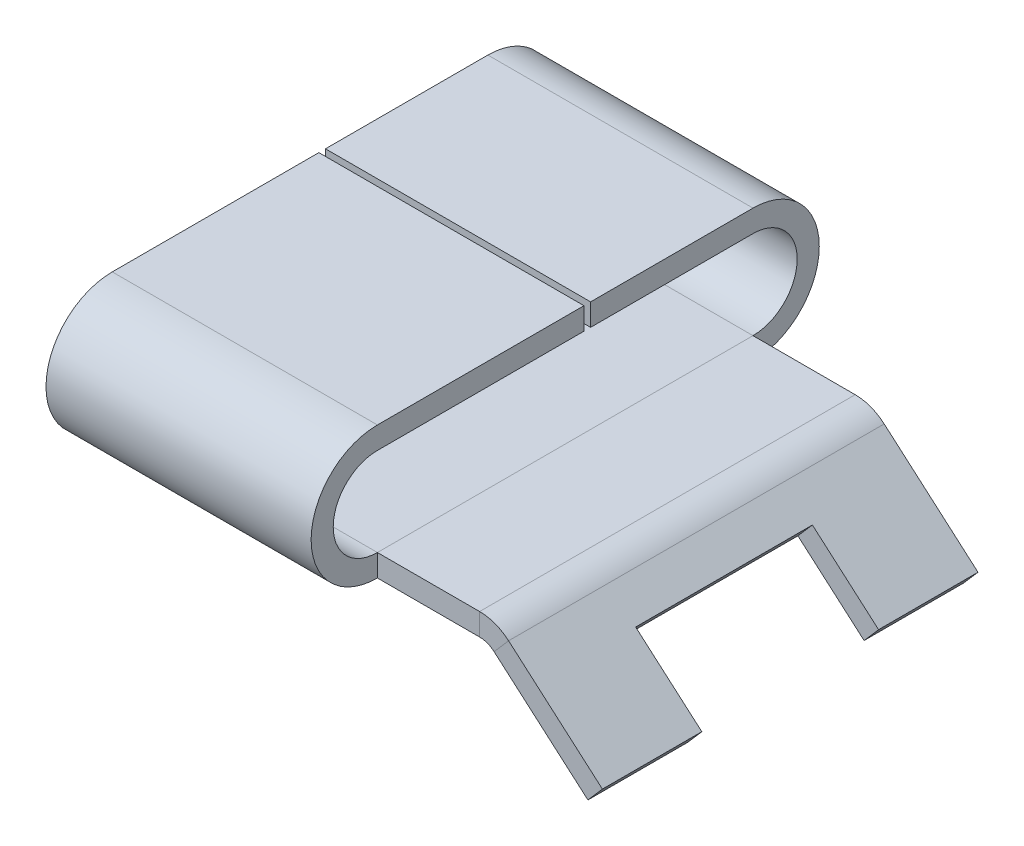
ISO-10303-21;
HEADER;
FILE_DESCRIPTION(('STEP AP214'),'2;1');
FILE_NAME('part.step','',(''),(''),'','','');
FILE_SCHEMA(('AUTOMOTIVE_DESIGN { 1 0 10303 214 1 1 1 1 }'));
ENDSEC;
DATA;
#1=APPLICATION_CONTEXT('core data for automotive mechanical design processes');
#2=APPLICATION_PROTOCOL_DEFINITION('international standard','automotive_design',2000,#1);
#3=PRODUCT_CONTEXT('',#1,'mechanical');
#4=PRODUCT('Part','Part','',(#3));
#5=PRODUCT_RELATED_PRODUCT_CATEGORY('part','',(#4));
#6=PRODUCT_DEFINITION_FORMATION('','',#4);
#7=PRODUCT_DEFINITION_CONTEXT('part definition',#1,'design');
#8=PRODUCT_DEFINITION('design','',#6,#7);
#9=PRODUCT_DEFINITION_SHAPE('','',#8);
#10=(LENGTH_UNIT() NAMED_UNIT(*) SI_UNIT(.MILLI.,.METRE.));
#11=(NAMED_UNIT(*) PLANE_ANGLE_UNIT() SI_UNIT($,.RADIAN.));
#12=(NAMED_UNIT(*) SI_UNIT($,.STERADIAN.) SOLID_ANGLE_UNIT());
#13=UNCERTAINTY_MEASURE_WITH_UNIT(LENGTH_MEASURE(1.E-05),#10,'distance_accuracy_value','');
#14=(GEOMETRIC_REPRESENTATION_CONTEXT(3) GLOBAL_UNCERTAINTY_ASSIGNED_CONTEXT((#13)) GLOBAL_UNIT_ASSIGNED_CONTEXT((#10,
#11,#12)) REPRESENTATION_CONTEXT('',''));
#15=CARTESIAN_POINT('',(0.,0.,0.));
#16=DIRECTION('',(0.,0.,1.));
#17=DIRECTION('',(1.,0.,0.));
#18=AXIS2_PLACEMENT_3D('',#15,#16,#17);
#19=CARTESIAN_POINT('',(22.1843165103271,-6.1816445937203,8.5));
#20=DIRECTION('',(0.754709580222771,-0.656059028990509,0.));
#21=DIRECTION('',(0.656059028990509,0.754709580222771,0.));
#22=AXIS2_PLACEMENT_3D('',#19,#20,#21);
#23=PLANE('',#22);
#24=DIRECTION('',(-0.656059028990509,-0.754709580222771,0.));
#25=VECTOR('',#24,1.);
#26=CARTESIAN_POINT('',(12.2612803691565,-17.5967918742352,-4.));
#27=LINE('',#26,#25);
#28=CARTESIAN_POINT('',(22.1843165103271,-6.18164459372029,-4.));
#29=VERTEX_POINT('',#28);
#30=CARTESIAN_POINT('',(21.5282574813366,-6.93635417394306,-4.));
#31=VERTEX_POINT('',#30);
#32=EDGE_CURVE('E250',#29,#31,#27,.T.);
#33=ORIENTED_EDGE('',*,*,#32,.T.);
#34=DIRECTION('',(0.,0.,-1.));
#35=VECTOR('',#34,1.);
#36=CARTESIAN_POINT('',(21.5282574813366,-6.93635417394306,8.5));
#37=LINE('',#36,#35);
#38=CARTESIAN_POINT('',(21.5282574813366,-6.93635417394306,-8.5));
#39=VERTEX_POINT('',#38);
#40=EDGE_CURVE('E195',#31,#39,#37,.T.);
#41=ORIENTED_EDGE('',*,*,#40,.T.);
#42=DIRECTION('',(-0.656059028990509,-0.754709580222771,0.));
#43=VECTOR('',#42,1.);
#44=CARTESIAN_POINT('',(22.1843165103271,-6.1816445937203,-8.5));
#45=LINE('',#44,#43);
#46=CARTESIAN_POINT('',(22.1843165103271,-6.1816445937203,-8.5));
#47=VERTEX_POINT('',#46);
#48=EDGE_CURVE('E164',#47,#39,#45,.T.);
#49=ORIENTED_EDGE('',*,*,#48,.F.);
#50=DIRECTION('',(0.,0.,-1.));
#51=VECTOR('',#50,1.);
#52=CARTESIAN_POINT('',(22.1843165103271,-6.1816445937203,8.5));
#53=LINE('',#52,#51);
#54=EDGE_CURVE('E191',#29,#47,#53,.T.);
#55=ORIENTED_EDGE('',*,*,#54,.F.);
#56=EDGE_LOOP('',(#33,#41,#49,#55));
#57=FACE_BOUND('',#56,.T.);
#58=ADVANCED_FACE('F48',(#57),#23,.T.);
#59=CARTESIAN_POINT('',(16.6261153205152,-3.00000000000001,8.5));
#60=DIRECTION('',(0.,0.,1.));
#61=DIRECTION('',(1.,0.,0.));
#62=AXIS2_PLACEMENT_3D('',#59,#60,#61);
#63=PLANE('',#62);
#64=DIRECTION('',(0.,1.,0.));
#65=VECTOR('',#64,1.);
#66=CARTESIAN_POINT('',(16.6261153205152,-3.00000000000001,8.5));
#67=LINE('',#66,#65);
#68=CARTESIAN_POINT('',(16.6261153205152,-3.00000000000001,8.5));
#69=VERTEX_POINT('',#68);
#70=CARTESIAN_POINT('',(16.6261153205152,-2.00000000000001,8.5));
#71=VERTEX_POINT('',#70);
#72=EDGE_CURVE('E12',#69,#71,#67,.T.);
#73=ORIENTED_EDGE('',*,*,#72,.F.);
#74=CARTESIAN_POINT('',(16.6261153205152,-4.00000000000001,8.5));
#75=DIRECTION('',(0.,0.,-1.));
#76=DIRECTION('',(1.,0.,0.));
#77=AXIS2_PLACEMENT_3D('',#74,#75,#76);
#78=CIRCLE('',#77,0.999999999999999);
#79=CARTESIAN_POINT('',(17.2821743495057,-3.24529041977724,8.5));
#80=VERTEX_POINT('',#79);
#81=EDGE_CURVE('E148',#69,#80,#78,.T.);
#82=ORIENTED_EDGE('',*,*,#81,.T.);
#83=DIRECTION('',(-0.656059028990509,-0.754709580222771,0.));
#84=VECTOR('',#83,1.);
#85=CARTESIAN_POINT('',(17.9382333784962,-2.49058083955447,8.5));
#86=LINE('',#85,#84);
#87=CARTESIAN_POINT('',(17.9382333784962,-2.49058083955447,8.5));
#88=VERTEX_POINT('',#87);
#89=EDGE_CURVE('E56',#88,#80,#86,.T.);
#90=ORIENTED_EDGE('',*,*,#89,.F.);
#91=CARTESIAN_POINT('',(16.6261153205152,-4.00000000000001,8.5));
#92=DIRECTION('',(0.,0.,1.));
#93=DIRECTION('',(1.,0.,0.));
#94=AXIS2_PLACEMENT_3D('',#91,#92,#93);
#95=CIRCLE('',#94,2.);
#96=EDGE_CURVE('E155',#71,#88,#95,.F.);
#97=ORIENTED_EDGE('',*,*,#96,.F.);
#98=EDGE_LOOP('',(#73,#82,#90,#97));
#99=FACE_BOUND('',#98,.T.);
#100=ADVANCED_FACE('F50',(#99),#63,.T.);
#101=CARTESIAN_POINT('',(17.9382333784962,-2.49058083955447,8.5));
#102=DIRECTION('',(0.,0.,1.));
#103=DIRECTION('',(1.,0.,0.));
#104=AXIS2_PLACEMENT_3D('',#101,#102,#103);
#105=PLANE('',#104);
#106=DIRECTION('',(1.,0.,0.));
#107=VECTOR('',#106,1.);
#108=CARTESIAN_POINT('',(12.,-3.00000000000001,8.5));
#109=LINE('',#108,#107);
#110=CARTESIAN_POINT('',(12.,-3.00000000000001,8.5));
#111=VERTEX_POINT('',#110);
#112=EDGE_CURVE('E143',#111,#69,#109,.T.);
#113=ORIENTED_EDGE('',*,*,#112,.T.);
#114=ORIENTED_EDGE('',*,*,#72,.T.);
#115=DIRECTION('',(1.,0.,0.));
#116=VECTOR('',#115,1.);
#117=CARTESIAN_POINT('',(12.,-2.00000000000001,8.5));
#118=LINE('',#117,#116);
#119=CARTESIAN_POINT('',(12.,-2.00000000000001,8.5));
#120=VERTEX_POINT('',#119);
#121=EDGE_CURVE('E153',#120,#71,#118,.T.);
#122=ORIENTED_EDGE('',*,*,#121,.F.);
#123=DIRECTION('',(0.,1.,0.));
#124=VECTOR('',#123,1.);
#125=CARTESIAN_POINT('',(12.,-3.00000000000001,8.5));
#126=LINE('',#125,#124);
#127=EDGE_CURVE('E132',#111,#120,#126,.T.);
#128=ORIENTED_EDGE('',*,*,#127,.F.);
#129=EDGE_LOOP('',(#113,#114,#122,#128));
#130=FACE_BOUND('',#129,.T.);
#131=ADVANCED_FACE('F151',(#130),#105,.T.);
#132=CARTESIAN_POINT('',(17.2821743495057,-3.24529041977724,-8.5));
#133=DIRECTION('',(0.,0.,-1.));
#134=DIRECTION('',(-1.,0.,0.));
#135=AXIS2_PLACEMENT_3D('',#132,#133,#134);
#136=PLANE('',#135);
#137=DIRECTION('',(0.656059028990509,0.754709580222771,0.));
#138=VECTOR('',#137,1.);
#139=CARTESIAN_POINT('',(17.2821743495057,-3.24529041977724,-8.5));
#140=LINE('',#139,#138);
#141=CARTESIAN_POINT('',(17.2821743495057,-3.24529041977724,-8.5));
#142=VERTEX_POINT('',#141);
#143=CARTESIAN_POINT('',(17.9382333784962,-2.49058083955447,-8.5));
#144=VERTEX_POINT('',#143);
#145=EDGE_CURVE('E105',#142,#144,#140,.T.);
#146=ORIENTED_EDGE('',*,*,#145,.F.);
#147=CARTESIAN_POINT('',(16.6261153205152,-4.00000000000001,-8.5));
#148=DIRECTION('',(0.,0.,-1.));
#149=DIRECTION('',(1.,0.,0.));
#150=AXIS2_PLACEMENT_3D('',#147,#148,#149);
#151=CIRCLE('',#150,0.999999999999999);
#152=CARTESIAN_POINT('',(16.6261153205152,-3.00000000000001,-8.5));
#153=VERTEX_POINT('',#152);
#154=EDGE_CURVE('E179',#153,#142,#151,.T.);
#155=ORIENTED_EDGE('',*,*,#154,.F.);
#156=DIRECTION('',(0.,-1.,0.));
#157=VECTOR('',#156,1.);
#158=CARTESIAN_POINT('',(16.6261153205152,-2.00000000000001,-8.5));
#159=LINE('',#158,#157);
#160=CARTESIAN_POINT('',(16.6261153205152,-2.00000000000001,-8.5));
#161=VERTEX_POINT('',#160);
#162=EDGE_CURVE('E199',#161,#153,#159,.T.);
#163=ORIENTED_EDGE('',*,*,#162,.F.);
#164=CARTESIAN_POINT('',(16.6261153205152,-4.00000000000001,-8.5));
#165=DIRECTION('',(0.,0.,1.));
#166=DIRECTION('',(1.,0.,0.));
#167=AXIS2_PLACEMENT_3D('',#164,#165,#166);
#168=CIRCLE('',#167,2.);
#169=EDGE_CURVE('E171',#161,#144,#168,.F.);
#170=ORIENTED_EDGE('',*,*,#169,.T.);
#171=EDGE_LOOP('',(#146,#155,#163,#170));
#172=FACE_BOUND('',#171,.T.);
#173=ADVANCED_FACE('F217',(#172),#136,.T.);
#174=CARTESIAN_POINT('',(16.6261153205152,-2.00000000000001,-8.5));
#175=DIRECTION('',(0.,0.,-1.));
#176=DIRECTION('',(-1.,0.,0.));
#177=AXIS2_PLACEMENT_3D('',#174,#175,#176);
#178=PLANE('',#177);
#179=DIRECTION('',(0.754709580222771,-0.656059028990509,0.));
#180=VECTOR('',#179,1.);
#181=CARTESIAN_POINT('',(17.2821743495057,-3.24529041977724,-8.5));
#182=LINE('',#181,#180);
#183=EDGE_CURVE('E161',#142,#39,#182,.T.);
#184=ORIENTED_EDGE('',*,*,#183,.F.);
#185=ORIENTED_EDGE('',*,*,#145,.T.);
#186=DIRECTION('',(0.754709580222771,-0.656059028990509,0.));
#187=VECTOR('',#186,1.);
#188=CARTESIAN_POINT('',(17.9382333784962,-2.49058083955447,-8.5));
#189=LINE('',#188,#187);
#190=EDGE_CURVE('E168',#144,#47,#189,.T.);
#191=ORIENTED_EDGE('',*,*,#190,.T.);
#192=ORIENTED_EDGE('',*,*,#48,.T.);
#193=EDGE_LOOP('',(#184,#185,#191,#192));
#194=FACE_BOUND('',#193,.T.);
#195=ADVANCED_FACE('F203',(#194),#178,.T.);
#196=CARTESIAN_POINT('',(17.2821743495057,-3.24529041977724,8.5));
#197=DIRECTION('',(0.656059028990509,0.754709580222771,0.));
#198=DIRECTION('',(-0.754709580222771,0.656059028990509,0.));
#199=AXIS2_PLACEMENT_3D('',#196,#197,#198);
#200=PLANE('',#199);
#201=ORIENTED_EDGE('',*,*,#40,.F.);
#202=DIRECTION('',(0.754709580222771,-0.656059028990509,0.));
#203=VECTOR('',#202,1.);
#204=CARTESIAN_POINT('',(18.532541406042,-4.33221791942655,-4.));
#205=LINE('',#204,#203);
#206=CARTESIAN_POINT('',(18.532541406042,-4.33221791942655,-4.));
#207=VERTEX_POINT('',#206);
#208=EDGE_CURVE('E244',#207,#31,#205,.T.);
#209=ORIENTED_EDGE('',*,*,#208,.F.);
#210=DIRECTION('',(0.,0.,-1.));
#211=VECTOR('',#210,1.);
#212=CARTESIAN_POINT('',(18.532541406042,-4.33221791942655,4.));
#213=LINE('',#212,#211);
#214=CARTESIAN_POINT('',(18.532541406042,-4.33221791942655,4.));
#215=VERTEX_POINT('',#214);
#216=EDGE_CURVE('E165',#215,#207,#213,.T.);
#217=ORIENTED_EDGE('',*,*,#216,.F.);
#218=DIRECTION('',(-0.754709580222771,0.656059028990509,0.));
#219=VECTOR('',#218,1.);
#220=CARTESIAN_POINT('',(18.532541406042,-4.33221791942655,4.));
#221=LINE('',#220,#219);
#222=CARTESIAN_POINT('',(21.5282574813366,-6.93635417394306,4.));
#223=VERTEX_POINT('',#222);
#224=EDGE_CURVE('E247',#223,#215,#221,.T.);
#225=ORIENTED_EDGE('',*,*,#224,.F.);
#226=CARTESIAN_POINT('',(21.5282574813366,-6.93635417394306,8.5));
#227=VERTEX_POINT('',#226);
#228=EDGE_CURVE('E196',#227,#223,#37,.T.);
#229=ORIENTED_EDGE('',*,*,#228,.F.);
#230=DIRECTION('',(0.754709580222771,-0.656059028990509,0.));
#231=VECTOR('',#230,1.);
#232=CARTESIAN_POINT('',(17.2821743495057,-3.24529041977724,8.5));
#233=LINE('',#232,#231);
#234=EDGE_CURVE('E111',#80,#227,#233,.T.);
#235=ORIENTED_EDGE('',*,*,#234,.F.);
#236=DIRECTION('',(0.,0.,-1.));
#237=VECTOR('',#236,1.);
#238=CARTESIAN_POINT('',(17.2821743495057,-3.24529041977724,8.5));
#239=LINE('',#238,#237);
#240=EDGE_CURVE('E160',#80,#142,#239,.T.);
#241=ORIENTED_EDGE('',*,*,#240,.T.);
#242=ORIENTED_EDGE('',*,*,#183,.T.);
#243=EDGE_LOOP('',(#201,#209,#217,#225,#229,#235,#241,#242));
#244=FACE_BOUND('',#243,.T.);
#245=ADVANCED_FACE('F289',(#244),#200,.F.);
#246=DIRECTION('',(0.656059028990509,0.754709580222771,0.));
#247=VECTOR('',#246,1.);
#248=CARTESIAN_POINT('',(12.2612803691565,-17.5967918742352,4.));
#249=LINE('',#248,#247);
#250=CARTESIAN_POINT('',(22.1843165103271,-6.1816445937203,4.));
#251=VERTEX_POINT('',#250);
#252=EDGE_CURVE('E253',#223,#251,#249,.T.);
#253=ORIENTED_EDGE('',*,*,#252,.T.);
#254=CARTESIAN_POINT('',(22.1843165103271,-6.1816445937203,8.5));
#255=VERTEX_POINT('',#254);
#256=EDGE_CURVE('E192',#255,#251,#53,.T.);
#257=ORIENTED_EDGE('',*,*,#256,.F.);
#258=DIRECTION('',(-0.656059028990509,-0.754709580222771,0.));
#259=VECTOR('',#258,1.);
#260=CARTESIAN_POINT('',(22.1843165103271,-6.1816445937203,8.5));
#261=LINE('',#260,#259);
#262=EDGE_CURVE('E224',#255,#227,#261,.T.);
#263=ORIENTED_EDGE('',*,*,#262,.T.);
#264=ORIENTED_EDGE('',*,*,#228,.T.);
#265=EDGE_LOOP('',(#253,#257,#263,#264));
#266=FACE_BOUND('',#265,.T.);
#267=ADVANCED_FACE('F258',(#266),#23,.T.);
#268=CARTESIAN_POINT('',(17.9382333784962,-2.49058083955447,8.5));
#269=DIRECTION('',(0.656059028990509,0.754709580222771,0.));
#270=DIRECTION('',(-0.754709580222771,0.656059028990509,0.));
#271=AXIS2_PLACEMENT_3D('',#268,#269,#270);
#272=PLANE('',#271);
#273=DIRECTION('',(-0.754709580222771,0.656059028990509,0.));
#274=VECTOR('',#273,1.);
#275=CARTESIAN_POINT('',(19.1886004350325,-3.57750833920378,-4.));
#276=LINE('',#275,#274);
#277=CARTESIAN_POINT('',(19.1886004350325,-3.57750833920378,-4.));
#278=VERTEX_POINT('',#277);
#279=EDGE_CURVE('E63',#29,#278,#276,.T.);
#280=ORIENTED_EDGE('',*,*,#279,.F.);
#281=ORIENTED_EDGE('',*,*,#54,.T.);
#282=ORIENTED_EDGE('',*,*,#190,.F.);
#283=DIRECTION('',(0.,0.,-1.));
#284=VECTOR('',#283,1.);
#285=CARTESIAN_POINT('',(17.9382333784962,-2.49058083955447,8.5));
#286=LINE('',#285,#284);
#287=EDGE_CURVE('E188',#88,#144,#286,.T.);
#288=ORIENTED_EDGE('',*,*,#287,.F.);
#289=DIRECTION('',(0.754709580222771,-0.656059028990509,0.));
#290=VECTOR('',#289,1.);
#291=CARTESIAN_POINT('',(17.9382333784962,-2.49058083955447,8.5));
#292=LINE('',#291,#290);
#293=EDGE_CURVE('E223',#88,#255,#292,.T.);
#294=ORIENTED_EDGE('',*,*,#293,.T.);
#295=ORIENTED_EDGE('',*,*,#256,.T.);
#296=DIRECTION('',(0.754709580222771,-0.656059028990509,0.));
#297=VECTOR('',#296,1.);
#298=CARTESIAN_POINT('',(19.1886004350325,-3.57750833920378,4.));
#299=LINE('',#298,#297);
#300=CARTESIAN_POINT('',(19.1886004350325,-3.57750833920378,4.));
#301=VERTEX_POINT('',#300);
#302=EDGE_CURVE('E235',#301,#251,#299,.T.);
#303=ORIENTED_EDGE('',*,*,#302,.F.);
#304=DIRECTION('',(0.,0.,1.));
#305=VECTOR('',#304,1.);
#306=CARTESIAN_POINT('',(19.1886004350325,-3.57750833920378,4.));
#307=LINE('',#306,#305);
#308=EDGE_CURVE('E240',#278,#301,#307,.T.);
#309=ORIENTED_EDGE('',*,*,#308,.F.);
#310=EDGE_LOOP('',(#280,#281,#282,#288,#294,#295,#303,#309));
#311=FACE_BOUND('',#310,.T.);
#312=ADVANCED_FACE('F214',(#311),#272,.T.);
#313=CARTESIAN_POINT('',(16.6261153205152,-4.00000000000001,8.5));
#314=DIRECTION('',(0.,0.,-1.));
#315=DIRECTION('',(-1.,0.,0.));
#316=AXIS2_PLACEMENT_3D('',#313,#314,#315);
#317=CYLINDRICAL_SURFACE('',#316,2.);
#318=ORIENTED_EDGE('',*,*,#169,.F.);
#319=DIRECTION('',(0.,0.,-1.));
#320=VECTOR('',#319,1.);
#321=CARTESIAN_POINT('',(16.6261153205152,-2.00000000000001,8.5));
#322=LINE('',#321,#320);
#323=EDGE_CURVE('E185',#71,#161,#322,.T.);
#324=ORIENTED_EDGE('',*,*,#323,.F.);
#325=ORIENTED_EDGE('',*,*,#96,.T.);
#326=ORIENTED_EDGE('',*,*,#287,.T.);
#327=EDGE_LOOP('',(#318,#324,#325,#326));
#328=FACE_BOUND('',#327,.T.);
#329=ADVANCED_FACE('F209',(#328),#317,.T.);
#330=CARTESIAN_POINT('',(12.,-2.00000000000001,8.5));
#331=DIRECTION('',(0.,1.,0.));
#332=DIRECTION('',(0.,0.,1.));
#333=AXIS2_PLACEMENT_3D('',#330,#331,#332);
#334=PLANE('',#333);
#335=DIRECTION('',(1.,0.,0.));
#336=VECTOR('',#335,1.);
#337=CARTESIAN_POINT('',(12.,-2.00000000000001,-8.5));
#338=LINE('',#337,#336);
#339=CARTESIAN_POINT('',(12.,-2.00000000000001,-8.5));
#340=VERTEX_POINT('',#339);
#341=EDGE_CURVE('E173',#340,#161,#338,.T.);
#342=ORIENTED_EDGE('',*,*,#341,.F.);
#343=DIRECTION('',(0.,0.,-1.));
#344=VECTOR('',#343,1.);
#345=CARTESIAN_POINT('',(12.,-2.00000000000001,8.5));
#346=LINE('',#345,#344);
#347=EDGE_CURVE('E138',#120,#340,#346,.T.);
#348=ORIENTED_EDGE('',*,*,#347,.F.);
#349=ORIENTED_EDGE('',*,*,#121,.T.);
#350=ORIENTED_EDGE('',*,*,#323,.T.);
#351=EDGE_LOOP('',(#342,#348,#349,#350));
#352=FACE_BOUND('',#351,.T.);
#353=ADVANCED_FACE('F221',(#352),#334,.T.);
#354=CARTESIAN_POINT('',(12.,-3.00000000000001,8.5));
#355=DIRECTION('',(-1.,0.,0.));
#356=DIRECTION('',(0.,0.,1.));
#357=AXIS2_PLACEMENT_3D('',#354,#355,#356);
#358=PLANE('',#357);
#359=DIRECTION('',(0.,1.,0.));
#360=VECTOR('',#359,1.);
#361=CARTESIAN_POINT('',(12.,-3.00000000000001,-8.5));
#362=LINE('',#361,#360);
#363=CARTESIAN_POINT('',(12.,-3.00000000000001,-8.5));
#364=VERTEX_POINT('',#363);
#365=EDGE_CURVE('E134',#364,#340,#362,.T.);
#366=ORIENTED_EDGE('',*,*,#365,.F.);
#367=DIRECTION('',(0.,0.,-1.));
#368=VECTOR('',#367,1.);
#369=CARTESIAN_POINT('',(12.,-3.00000000000001,8.5));
#370=LINE('',#369,#368);
#371=EDGE_CURVE('E128',#111,#364,#370,.T.);
#372=ORIENTED_EDGE('',*,*,#371,.F.);
#373=ORIENTED_EDGE('',*,*,#127,.T.);
#374=ORIENTED_EDGE('',*,*,#347,.T.);
#375=EDGE_LOOP('',(#366,#372,#373,#374));
#376=FACE_BOUND('',#375,.T.);
#377=ADVANCED_FACE('F130',(#376),#358,.T.);
#378=CARTESIAN_POINT('',(12.,-3.00000000000001,8.5));
#379=DIRECTION('',(0.,1.,0.));
#380=DIRECTION('',(0.,0.,1.));
#381=AXIS2_PLACEMENT_3D('',#378,#379,#380);
#382=PLANE('',#381);
#383=DIRECTION('',(1.,0.,0.));
#384=VECTOR('',#383,1.);
#385=CARTESIAN_POINT('',(12.,-3.00000000000001,-8.5));
#386=LINE('',#385,#384);
#387=EDGE_CURVE('E177',#364,#153,#386,.T.);
#388=ORIENTED_EDGE('',*,*,#387,.T.);
#389=DIRECTION('',(0.,0.,-1.));
#390=VECTOR('',#389,1.);
#391=CARTESIAN_POINT('',(16.6261153205152,-3.00000000000001,8.5));
#392=LINE('',#391,#390);
#393=EDGE_CURVE('E139',#69,#153,#392,.T.);
#394=ORIENTED_EDGE('',*,*,#393,.F.);
#395=ORIENTED_EDGE('',*,*,#112,.F.);
#396=ORIENTED_EDGE('',*,*,#371,.T.);
#397=EDGE_LOOP('',(#388,#394,#395,#396));
#398=FACE_BOUND('',#397,.T.);
#399=ADVANCED_FACE('F144',(#398),#382,.F.);
#400=CARTESIAN_POINT('',(16.6261153205152,-4.00000000000001,8.5));
#401=DIRECTION('',(0.,0.,-1.));
#402=DIRECTION('',(-1.,0.,0.));
#403=AXIS2_PLACEMENT_3D('',#400,#401,#402);
#404=CYLINDRICAL_SURFACE('',#403,0.999999999999999);
#405=ORIENTED_EDGE('',*,*,#154,.T.);
#406=ORIENTED_EDGE('',*,*,#240,.F.);
#407=ORIENTED_EDGE('',*,*,#81,.F.);
#408=ORIENTED_EDGE('',*,*,#393,.T.);
#409=EDGE_LOOP('',(#405,#406,#407,#408));
#410=FACE_BOUND('',#409,.T.);
#411=ADVANCED_FACE('F269',(#410),#404,.F.);
#412=CARTESIAN_POINT('',(16.6261153205152,-4.00000000000001,8.5));
#413=DIRECTION('',(0.,0.,1.));
#414=DIRECTION('',(1.,0.,0.));
#415=AXIS2_PLACEMENT_3D('',#412,#413,#414);
#416=PLANE('',#415);
#417=ORIENTED_EDGE('',*,*,#234,.T.);
#418=ORIENTED_EDGE('',*,*,#262,.F.);
#419=ORIENTED_EDGE('',*,*,#293,.F.);
#420=ORIENTED_EDGE('',*,*,#89,.T.);
#421=EDGE_LOOP('',(#417,#418,#419,#420));
#422=FACE_BOUND('',#421,.T.);
#423=ADVANCED_FACE('F266',(#422),#416,.T.);
#424=CARTESIAN_POINT('',(16.6261153205152,-4.00000000000001,-8.5));
#425=DIRECTION('',(0.,0.,1.));
#426=DIRECTION('',(1.,0.,0.));
#427=AXIS2_PLACEMENT_3D('',#424,#425,#426);
#428=PLANE('',#427);
#429=ORIENTED_EDGE('',*,*,#341,.T.);
#430=ORIENTED_EDGE('',*,*,#162,.T.);
#431=ORIENTED_EDGE('',*,*,#387,.F.);
#432=ORIENTED_EDGE('',*,*,#365,.T.);
#433=EDGE_LOOP('',(#429,#430,#431,#432));
#434=FACE_BOUND('',#433,.T.);
#435=ADVANCED_FACE('F268',(#434),#428,.F.);
#436=CARTESIAN_POINT('',(9.26556429386191,-14.9926556197187,-4.));
#437=DIRECTION('',(0.,0.,-1.));
#438=DIRECTION('',(-1.,0.,0.));
#439=AXIS2_PLACEMENT_3D('',#436,#437,#438);
#440=PLANE('',#439);
#441=ORIENTED_EDGE('',*,*,#208,.T.);
#442=ORIENTED_EDGE('',*,*,#32,.F.);
#443=ORIENTED_EDGE('',*,*,#279,.T.);
#444=DIRECTION('',(0.656059028990509,0.754709580222771,0.));
#445=VECTOR('',#444,1.);
#446=CARTESIAN_POINT('',(9.26556429386191,-14.9926556197187,-4.));
#447=LINE('',#446,#445);
#448=EDGE_CURVE('E233',#207,#278,#447,.T.);
#449=ORIENTED_EDGE('',*,*,#448,.F.);
#450=EDGE_LOOP('',(#441,#442,#443,#449));
#451=FACE_BOUND('',#450,.T.);
#452=ADVANCED_FACE('F275',(#451),#440,.F.);
#453=CARTESIAN_POINT('',(9.26556429386192,-14.9926556197187,4.));
#454=DIRECTION('',(0.,0.,1.));
#455=DIRECTION('',(1.,0.,0.));
#456=AXIS2_PLACEMENT_3D('',#453,#454,#455);
#457=PLANE('',#456);
#458=ORIENTED_EDGE('',*,*,#224,.T.);
#459=DIRECTION('',(0.656059028990509,0.754709580222771,0.));
#460=VECTOR('',#459,1.);
#461=CARTESIAN_POINT('',(9.26556429386192,-14.9926556197187,4.));
#462=LINE('',#461,#460);
#463=EDGE_CURVE('E232',#215,#301,#462,.T.);
#464=ORIENTED_EDGE('',*,*,#463,.T.);
#465=ORIENTED_EDGE('',*,*,#302,.T.);
#466=ORIENTED_EDGE('',*,*,#252,.F.);
#467=EDGE_LOOP('',(#458,#464,#465,#466));
#468=FACE_BOUND('',#467,.T.);
#469=ADVANCED_FACE('F402',(#468),#457,.F.);
#470=CARTESIAN_POINT('',(9.26556429386192,-14.9926556197187,4.));
#471=DIRECTION('',(-0.754709580222771,0.656059028990509,0.));
#472=DIRECTION('',(-0.656059028990509,-0.754709580222771,0.));
#473=AXIS2_PLACEMENT_3D('',#470,#471,#472);
#474=PLANE('',#473);
#475=ORIENTED_EDGE('',*,*,#216,.T.);
#476=ORIENTED_EDGE('',*,*,#448,.T.);
#477=ORIENTED_EDGE('',*,*,#308,.T.);
#478=ORIENTED_EDGE('',*,*,#463,.F.);
#479=EDGE_LOOP('',(#475,#476,#477,#478));
#480=FACE_BOUND('',#479,.T.);
#481=ADVANCED_FACE('F410',(#480),#474,.F.);
#482=CLOSED_SHELL('',(#58,#100,#131,#173,#195,#245,#267,#312,#329,#353,#377,#399,#411,#423,#435,
#452,#469,#481));
#483=MANIFOLD_SOLID_BREP('B2',#482);
#484=CARTESIAN_POINT('',(12.,2.,-0.849999999999997));
#485=DIRECTION('',(0.,0.,1.));
#486=DIRECTION('',(1.,0.,0.));
#487=AXIS2_PLACEMENT_3D('',#484,#485,#486);
#488=PLANE('',#487);
#489=DIRECTION('',(0.,1.,0.));
#490=VECTOR('',#489,1.);
#491=CARTESIAN_POINT('',(0.,2.,-0.849999999999997));
#492=LINE('',#491,#490);
#493=CARTESIAN_POINT('',(0.,2.,-0.849999999999997));
#494=VERTEX_POINT('',#493);
#495=CARTESIAN_POINT('',(0.,3.,-0.849999999999997));
#496=VERTEX_POINT('',#495);
#497=EDGE_CURVE('E583',#494,#496,#492,.T.);
#498=ORIENTED_EDGE('',*,*,#497,.T.);
#499=DIRECTION('',(-1.,0.,0.));
#500=VECTOR('',#499,1.);
#501=CARTESIAN_POINT('',(12.,3.,-0.849999999999997));
#502=LINE('',#501,#500);
#503=CARTESIAN_POINT('',(12.,3.,-0.849999999999997));
#504=VERTEX_POINT('',#503);
#505=EDGE_CURVE('E46',#504,#496,#502,.T.);
#506=ORIENTED_EDGE('',*,*,#505,.F.);
#507=DIRECTION('',(0.,1.,0.));
#508=VECTOR('',#507,1.);
#509=CARTESIAN_POINT('',(12.,2.,-0.849999999999997));
#510=LINE('',#509,#508);
#511=CARTESIAN_POINT('',(12.,2.,-0.849999999999997));
#512=VERTEX_POINT('',#511);
#513=EDGE_CURVE('E613',#512,#504,#510,.T.);
#514=ORIENTED_EDGE('',*,*,#513,.F.);
#515=DIRECTION('',(-1.,0.,0.));
#516=VECTOR('',#515,1.);
#517=CARTESIAN_POINT('',(12.,2.,-0.849999999999997));
#518=LINE('',#517,#516);
#519=EDGE_CURVE('E478',#512,#494,#518,.T.);
#520=ORIENTED_EDGE('',*,*,#519,.T.);
#521=EDGE_LOOP('',(#498,#506,#514,#520));
#522=FACE_BOUND('',#521,.T.);
#523=ADVANCED_FACE('F462',(#522),#488,.F.);
#524=CARTESIAN_POINT('',(12.,3.,-0.849999999999997));
#525=DIRECTION('',(0.,-1.,0.));
#526=DIRECTION('',(0.,0.,-1.));
#527=AXIS2_PLACEMENT_3D('',#524,#525,#526);
#528=PLANE('',#527);
#529=DIRECTION('',(0.,0.,1.));
#530=VECTOR('',#529,1.);
#531=CARTESIAN_POINT('',(0.,3.,-0.849999999999997));
#532=LINE('',#531,#530);
#533=CARTESIAN_POINT('',(0.,3.,8.5));
#534=VERTEX_POINT('',#533);
#535=EDGE_CURVE('E585',#496,#534,#532,.T.);
#536=ORIENTED_EDGE('',*,*,#535,.T.);
#537=DIRECTION('',(-1.,0.,0.));
#538=VECTOR('',#537,1.);
#539=CARTESIAN_POINT('',(12.,3.,8.5));
#540=LINE('',#539,#538);
#541=CARTESIAN_POINT('',(12.,3.,8.5));
#542=VERTEX_POINT('',#541);
#543=EDGE_CURVE('E470',#542,#534,#540,.T.);
#544=ORIENTED_EDGE('',*,*,#543,.F.);
#545=DIRECTION('',(0.,0.,1.));
#546=VECTOR('',#545,1.);
#547=CARTESIAN_POINT('',(12.,3.,-0.849999999999997));
#548=LINE('',#547,#546);
#549=EDGE_CURVE('E528',#504,#542,#548,.T.);
#550=ORIENTED_EDGE('',*,*,#549,.F.);
#551=ORIENTED_EDGE('',*,*,#505,.T.);
#552=EDGE_LOOP('',(#536,#544,#550,#551));
#553=FACE_BOUND('',#552,.T.);
#554=ADVANCED_FACE('F675',(#553),#528,.F.);
#555=CARTESIAN_POINT('',(12.,0.,8.5));
#556=DIRECTION('',(-1.,0.,0.));
#557=DIRECTION('',(0.,0.,1.));
#558=AXIS2_PLACEMENT_3D('',#555,#556,#557);
#559=CYLINDRICAL_SURFACE('',#558,3.);
#560=CARTESIAN_POINT('',(0.,0.,8.5));
#561=DIRECTION('',(1.,0.,0.));
#562=DIRECTION('',(0.,0.,-1.));
#563=AXIS2_PLACEMENT_3D('',#560,#561,#562);
#564=CIRCLE('',#563,3.);
#565=CARTESIAN_POINT('',(0.,-3.,8.5));
#566=VERTEX_POINT('',#565);
#567=EDGE_CURVE('E587',#534,#566,#564,.T.);
#568=ORIENTED_EDGE('',*,*,#567,.T.);
#569=DIRECTION('',(-1.,0.,0.));
#570=VECTOR('',#569,1.);
#571=CARTESIAN_POINT('',(12.,-3.,8.5));
#572=LINE('',#571,#570);
#573=CARTESIAN_POINT('',(12.,-3.,8.5));
#574=VERTEX_POINT('',#573);
#575=EDGE_CURVE('E628',#574,#566,#572,.T.);
#576=ORIENTED_EDGE('',*,*,#575,.F.);
#577=CARTESIAN_POINT('',(12.,0.,8.5));
#578=DIRECTION('',(1.,0.,0.));
#579=DIRECTION('',(0.,0.,-1.));
#580=AXIS2_PLACEMENT_3D('',#577,#578,#579);
#581=CIRCLE('',#580,3.);
#582=EDGE_CURVE('E635',#542,#574,#581,.T.);
#583=ORIENTED_EDGE('',*,*,#582,.F.);
#584=ORIENTED_EDGE('',*,*,#543,.T.);
#585=EDGE_LOOP('',(#568,#576,#583,#584));
#586=FACE_BOUND('',#585,.T.);
#587=ADVANCED_FACE('F633',(#586),#559,.T.);
#588=CARTESIAN_POINT('',(12.,-3.00000000000004,-8.5));
#589=DIRECTION('',(0.,-1.,0.));
#590=DIRECTION('',(0.,0.,-1.));
#591=AXIS2_PLACEMENT_3D('',#588,#589,#590);
#592=PLANE('',#591);
#593=DIRECTION('',(0.,0.,1.));
#594=VECTOR('',#593,1.);
#595=CARTESIAN_POINT('',(0.,-3.00000000000004,-8.5));
#596=LINE('',#595,#594);
#597=CARTESIAN_POINT('',(0.,-3.00000000000004,-8.5));
#598=VERTEX_POINT('',#597);
#599=EDGE_CURVE('E590',#598,#566,#596,.T.);
#600=ORIENTED_EDGE('',*,*,#599,.F.);
#601=DIRECTION('',(-1.,0.,0.));
#602=VECTOR('',#601,1.);
#603=CARTESIAN_POINT('',(12.,-3.00000000000004,-8.5));
#604=LINE('',#603,#602);
#605=CARTESIAN_POINT('',(12.,-3.00000000000004,-8.5));
#606=VERTEX_POINT('',#605);
#607=EDGE_CURVE('E626',#606,#598,#604,.T.);
#608=ORIENTED_EDGE('',*,*,#607,.F.);
#609=DIRECTION('',(0.,0.,1.));
#610=VECTOR('',#609,1.);
#611=CARTESIAN_POINT('',(12.,-3.00000000000004,-8.5));
#612=LINE('',#611,#610);
#613=EDGE_CURVE('E646',#606,#574,#612,.T.);
#614=ORIENTED_EDGE('',*,*,#613,.T.);
#615=ORIENTED_EDGE('',*,*,#575,.T.);
#616=EDGE_LOOP('',(#600,#608,#614,#615));
#617=FACE_BOUND('',#616,.T.);
#618=ADVANCED_FACE('F642',(#617),#592,.T.);
#619=CARTESIAN_POINT('',(12.,0.,-8.5));
#620=DIRECTION('',(-1.,0.,0.));
#621=DIRECTION('',(0.,0.,1.));
#622=AXIS2_PLACEMENT_3D('',#619,#620,#621);
#623=CYLINDRICAL_SURFACE('',#622,3.00000000000002);
#624=CARTESIAN_POINT('',(0.,0.,-8.5));
#625=DIRECTION('',(1.,0.,0.));
#626=DIRECTION('',(0.,0.,-1.));
#627=AXIS2_PLACEMENT_3D('',#624,#625,#626);
#628=CIRCLE('',#627,3.00000000000002);
#629=CARTESIAN_POINT('',(0.,3.,-8.5));
#630=VERTEX_POINT('',#629);
#631=EDGE_CURVE('E593',#598,#630,#628,.T.);
#632=ORIENTED_EDGE('',*,*,#631,.T.);
#633=DIRECTION('',(-1.,0.,0.));
#634=VECTOR('',#633,1.);
#635=CARTESIAN_POINT('',(12.,3.,-8.5));
#636=LINE('',#635,#634);
#637=CARTESIAN_POINT('',(12.,3.,-8.5));
#638=VERTEX_POINT('',#637);
#639=EDGE_CURVE('E623',#638,#630,#636,.T.);
#640=ORIENTED_EDGE('',*,*,#639,.F.);
#641=CARTESIAN_POINT('',(12.,0.,-8.5));
#642=DIRECTION('',(1.,0.,0.));
#643=DIRECTION('',(0.,0.,-1.));
#644=AXIS2_PLACEMENT_3D('',#641,#642,#643);
#645=CIRCLE('',#644,3.00000000000002);
#646=EDGE_CURVE('E647',#606,#638,#645,.T.);
#647=ORIENTED_EDGE('',*,*,#646,.F.);
#648=ORIENTED_EDGE('',*,*,#607,.T.);
#649=EDGE_LOOP('',(#632,#640,#647,#648));
#650=FACE_BOUND('',#649,.T.);
#651=ADVANCED_FACE('F688',(#650),#623,.T.);
#652=CARTESIAN_POINT('',(12.,3.,-8.5));
#653=DIRECTION('',(0.,-1.,0.));
#654=DIRECTION('',(0.,0.,-1.));
#655=AXIS2_PLACEMENT_3D('',#652,#653,#654);
#656=PLANE('',#655);
#657=DIRECTION('',(0.,0.,1.));
#658=VECTOR('',#657,1.);
#659=CARTESIAN_POINT('',(0.,3.,-8.5));
#660=LINE('',#659,#658);
#661=CARTESIAN_POINT('',(0.,3.,-1.15));
#662=VERTEX_POINT('',#661);
#663=EDGE_CURVE('E595',#630,#662,#660,.T.);
#664=ORIENTED_EDGE('',*,*,#663,.T.);
#665=DIRECTION('',(-1.,0.,0.));
#666=VECTOR('',#665,1.);
#667=CARTESIAN_POINT('',(12.,3.,-1.15));
#668=LINE('',#667,#666);
#669=CARTESIAN_POINT('',(12.,3.,-1.15));
#670=VERTEX_POINT('',#669);
#671=EDGE_CURVE('E621',#670,#662,#668,.T.);
#672=ORIENTED_EDGE('',*,*,#671,.F.);
#673=DIRECTION('',(0.,0.,1.));
#674=VECTOR('',#673,1.);
#675=CARTESIAN_POINT('',(12.,3.,-8.5));
#676=LINE('',#675,#674);
#677=EDGE_CURVE('E649',#638,#670,#676,.T.);
#678=ORIENTED_EDGE('',*,*,#677,.F.);
#679=ORIENTED_EDGE('',*,*,#639,.T.);
#680=EDGE_LOOP('',(#664,#672,#678,#679));
#681=FACE_BOUND('',#680,.T.);
#682=ADVANCED_FACE('F691',(#681),#656,.F.);
#683=CARTESIAN_POINT('',(12.,2.,-1.15));
#684=DIRECTION('',(0.,0.,1.));
#685=DIRECTION('',(1.,0.,0.));
#686=AXIS2_PLACEMENT_3D('',#683,#684,#685);
#687=PLANE('',#686);
#688=DIRECTION('',(0.,1.,0.));
#689=VECTOR('',#688,1.);
#690=CARTESIAN_POINT('',(0.,2.,-1.15));
#691=LINE('',#690,#689);
#692=CARTESIAN_POINT('',(0.,2.,-1.15));
#693=VERTEX_POINT('',#692);
#694=EDGE_CURVE('E598',#693,#662,#691,.T.);
#695=ORIENTED_EDGE('',*,*,#694,.F.);
#696=DIRECTION('',(-1.,0.,0.));
#697=VECTOR('',#696,1.);
#698=CARTESIAN_POINT('',(12.,2.,-1.15));
#699=LINE('',#698,#697);
#700=CARTESIAN_POINT('',(12.,2.,-1.15));
#701=VERTEX_POINT('',#700);
#702=EDGE_CURVE('E619',#701,#693,#699,.T.);
#703=ORIENTED_EDGE('',*,*,#702,.F.);
#704=DIRECTION('',(0.,1.,0.));
#705=VECTOR('',#704,1.);
#706=CARTESIAN_POINT('',(12.,2.,-1.15));
#707=LINE('',#706,#705);
#708=EDGE_CURVE('E655',#701,#670,#707,.T.);
#709=ORIENTED_EDGE('',*,*,#708,.T.);
#710=ORIENTED_EDGE('',*,*,#671,.T.);
#711=EDGE_LOOP('',(#695,#703,#709,#710));
#712=FACE_BOUND('',#711,.T.);
#713=ADVANCED_FACE('F695',(#712),#687,.T.);
#714=CARTESIAN_POINT('',(12.,2.,-8.5));
#715=DIRECTION('',(0.,-1.,0.));
#716=DIRECTION('',(0.,0.,-1.));
#717=AXIS2_PLACEMENT_3D('',#714,#715,#716);
#718=PLANE('',#717);
#719=DIRECTION('',(0.,0.,1.));
#720=VECTOR('',#719,1.);
#721=CARTESIAN_POINT('',(0.,2.,-8.5));
#722=LINE('',#721,#720);
#723=CARTESIAN_POINT('',(0.,2.,-8.5));
#724=VERTEX_POINT('',#723);
#725=EDGE_CURVE('E601',#724,#693,#722,.T.);
#726=ORIENTED_EDGE('',*,*,#725,.F.);
#727=DIRECTION('',(-1.,0.,0.));
#728=VECTOR('',#727,1.);
#729=CARTESIAN_POINT('',(12.,2.,-8.5));
#730=LINE('',#729,#728);
#731=CARTESIAN_POINT('',(12.,2.,-8.5));
#732=VERTEX_POINT('',#731);
#733=EDGE_CURVE('E617',#732,#724,#730,.T.);
#734=ORIENTED_EDGE('',*,*,#733,.F.);
#735=DIRECTION('',(0.,0.,1.));
#736=VECTOR('',#735,1.);
#737=CARTESIAN_POINT('',(12.,2.,-8.5));
#738=LINE('',#737,#736);
#739=EDGE_CURVE('E658',#732,#701,#738,.T.);
#740=ORIENTED_EDGE('',*,*,#739,.T.);
#741=ORIENTED_EDGE('',*,*,#702,.T.);
#742=EDGE_LOOP('',(#726,#734,#740,#741));
#743=FACE_BOUND('',#742,.T.);
#744=ADVANCED_FACE('F699',(#743),#718,.T.);
#745=CARTESIAN_POINT('',(12.,0.,-8.5));
#746=DIRECTION('',(-1.,0.,0.));
#747=DIRECTION('',(0.,0.,1.));
#748=AXIS2_PLACEMENT_3D('',#745,#746,#747);
#749=CYLINDRICAL_SURFACE('',#748,2.);
#750=CARTESIAN_POINT('',(0.,0.,-8.5));
#751=DIRECTION('',(1.,0.,0.));
#752=DIRECTION('',(0.,0.,-1.));
#753=AXIS2_PLACEMENT_3D('',#750,#751,#752);
#754=CIRCLE('',#753,2.);
#755=CARTESIAN_POINT('',(0.,-2.00000000000002,-8.5));
#756=VERTEX_POINT('',#755);
#757=EDGE_CURVE('E604',#756,#724,#754,.T.);
#758=ORIENTED_EDGE('',*,*,#757,.F.);
#759=DIRECTION('',(-1.,0.,0.));
#760=VECTOR('',#759,1.);
#761=CARTESIAN_POINT('',(12.,-2.00000000000002,-8.5));
#762=LINE('',#761,#760);
#763=CARTESIAN_POINT('',(12.,-2.00000000000002,-8.5));
#764=VERTEX_POINT('',#763);
#765=EDGE_CURVE('E575',#764,#756,#762,.T.);
#766=ORIENTED_EDGE('',*,*,#765,.F.);
#767=CARTESIAN_POINT('',(12.,0.,-8.5));
#768=DIRECTION('',(1.,0.,0.));
#769=DIRECTION('',(0.,0.,-1.));
#770=AXIS2_PLACEMENT_3D('',#767,#768,#769);
#771=CIRCLE('',#770,2.);
#772=EDGE_CURVE('E565',#764,#732,#771,.T.);
#773=ORIENTED_EDGE('',*,*,#772,.T.);
#774=ORIENTED_EDGE('',*,*,#733,.T.);
#775=EDGE_LOOP('',(#758,#766,#773,#774));
#776=FACE_BOUND('',#775,.T.);
#777=ADVANCED_FACE('F662',(#776),#749,.F.);
#778=CARTESIAN_POINT('',(12.,-2.,-8.5));
#779=DIRECTION('',(0.,-1.,0.));
#780=DIRECTION('',(0.,0.,-1.));
#781=AXIS2_PLACEMENT_3D('',#778,#779,#780);
#782=PLANE('',#781);
#783=DIRECTION('',(0.,0.,1.));
#784=VECTOR('',#783,1.);
#785=CARTESIAN_POINT('',(0.,-2.,-8.5));
#786=LINE('',#785,#784);
#787=CARTESIAN_POINT('',(0.,-2.,8.5));
#788=VERTEX_POINT('',#787);
#789=EDGE_CURVE('E572',#756,#788,#786,.T.);
#790=ORIENTED_EDGE('',*,*,#789,.T.);
#791=DIRECTION('',(-1.,0.,0.));
#792=VECTOR('',#791,1.);
#793=CARTESIAN_POINT('',(12.,-2.,8.5));
#794=LINE('',#793,#792);
#795=CARTESIAN_POINT('',(12.,-2.,8.5));
#796=VERTEX_POINT('',#795);
#797=EDGE_CURVE('E569',#796,#788,#794,.T.);
#798=ORIENTED_EDGE('',*,*,#797,.F.);
#799=DIRECTION('',(0.,0.,1.));
#800=VECTOR('',#799,1.);
#801=CARTESIAN_POINT('',(12.,-2.,-8.5));
#802=LINE('',#801,#800);
#803=EDGE_CURVE('E557',#764,#796,#802,.T.);
#804=ORIENTED_EDGE('',*,*,#803,.F.);
#805=ORIENTED_EDGE('',*,*,#765,.T.);
#806=EDGE_LOOP('',(#790,#798,#804,#805));
#807=FACE_BOUND('',#806,.T.);
#808=ADVANCED_FACE('F570',(#807),#782,.F.);
#809=CARTESIAN_POINT('',(12.,0.,8.5));
#810=DIRECTION('',(-1.,0.,0.));
#811=DIRECTION('',(0.,0.,1.));
#812=AXIS2_PLACEMENT_3D('',#809,#810,#811);
#813=CYLINDRICAL_SURFACE('',#812,2.);
#814=CARTESIAN_POINT('',(0.,0.,8.5));
#815=DIRECTION('',(1.,0.,0.));
#816=DIRECTION('',(0.,0.,-1.));
#817=AXIS2_PLACEMENT_3D('',#814,#815,#816);
#818=CIRCLE('',#817,2.);
#819=CARTESIAN_POINT('',(0.,2.,8.5));
#820=VERTEX_POINT('',#819);
#821=EDGE_CURVE('E608',#820,#788,#818,.T.);
#822=ORIENTED_EDGE('',*,*,#821,.F.);
#823=DIRECTION('',(-1.,0.,0.));
#824=VECTOR('',#823,1.);
#825=CARTESIAN_POINT('',(12.,2.,8.5));
#826=LINE('',#825,#824);
#827=CARTESIAN_POINT('',(12.,2.,8.5));
#828=VERTEX_POINT('',#827);
#829=EDGE_CURVE('E516',#828,#820,#826,.T.);
#830=ORIENTED_EDGE('',*,*,#829,.F.);
#831=CARTESIAN_POINT('',(12.,0.,8.5));
#832=DIRECTION('',(1.,0.,0.));
#833=DIRECTION('',(0.,0.,-1.));
#834=AXIS2_PLACEMENT_3D('',#831,#832,#833);
#835=CIRCLE('',#834,2.);
#836=EDGE_CURVE('E562',#828,#796,#835,.T.);
#837=ORIENTED_EDGE('',*,*,#836,.T.);
#838=ORIENTED_EDGE('',*,*,#797,.T.);
#839=EDGE_LOOP('',(#822,#830,#837,#838));
#840=FACE_BOUND('',#839,.T.);
#841=ADVANCED_FACE('F577',(#840),#813,.F.);
#842=CARTESIAN_POINT('',(12.,2.,-0.849999999999997));
#843=DIRECTION('',(0.,-1.,0.));
#844=DIRECTION('',(0.,0.,-1.));
#845=AXIS2_PLACEMENT_3D('',#842,#843,#844);
#846=PLANE('',#845);
#847=DIRECTION('',(0.,0.,1.));
#848=VECTOR('',#847,1.);
#849=CARTESIAN_POINT('',(0.,2.,-0.849999999999997));
#850=LINE('',#849,#848);
#851=EDGE_CURVE('E610',#494,#820,#850,.T.);
#852=ORIENTED_EDGE('',*,*,#851,.F.);
#853=ORIENTED_EDGE('',*,*,#519,.F.);
#854=DIRECTION('',(0.,0.,1.));
#855=VECTOR('',#854,1.);
#856=CARTESIAN_POINT('',(12.,2.,-0.849999999999997));
#857=LINE('',#856,#855);
#858=EDGE_CURVE('E578',#512,#828,#857,.T.);
#859=ORIENTED_EDGE('',*,*,#858,.T.);
#860=ORIENTED_EDGE('',*,*,#829,.T.);
#861=EDGE_LOOP('',(#852,#853,#859,#860));
#862=FACE_BOUND('',#861,.T.);
#863=ADVANCED_FACE('F664',(#862),#846,.T.);
#864=CARTESIAN_POINT('',(12.,0.,8.5));
#865=DIRECTION('',(1.,0.,0.));
#866=DIRECTION('',(0.,0.,-1.));
#867=AXIS2_PLACEMENT_3D('',#864,#865,#866);
#868=PLANE('',#867);
#869=ORIENTED_EDGE('',*,*,#513,.T.);
#870=ORIENTED_EDGE('',*,*,#549,.T.);
#871=ORIENTED_EDGE('',*,*,#582,.T.);
#872=ORIENTED_EDGE('',*,*,#613,.F.);
#873=ORIENTED_EDGE('',*,*,#646,.T.);
#874=ORIENTED_EDGE('',*,*,#677,.T.);
#875=ORIENTED_EDGE('',*,*,#708,.F.);
#876=ORIENTED_EDGE('',*,*,#739,.F.);
#877=ORIENTED_EDGE('',*,*,#772,.F.);
#878=ORIENTED_EDGE('',*,*,#803,.T.);
#879=ORIENTED_EDGE('',*,*,#836,.F.);
#880=ORIENTED_EDGE('',*,*,#858,.F.);
#881=EDGE_LOOP('',(#869,#870,#871,#872,#873,#874,#875,#876,#877,#878,#879,#880));
#882=FACE_BOUND('',#881,.T.);
#883=ADVANCED_FACE('F559',(#882),#868,.T.);
#884=CARTESIAN_POINT('',(0.,0.,8.5));
#885=DIRECTION('',(1.,0.,0.));
#886=DIRECTION('',(0.,0.,-1.));
#887=AXIS2_PLACEMENT_3D('',#884,#885,#886);
#888=PLANE('',#887);
#889=ORIENTED_EDGE('',*,*,#497,.F.);
#890=ORIENTED_EDGE('',*,*,#851,.T.);
#891=ORIENTED_EDGE('',*,*,#821,.T.);
#892=ORIENTED_EDGE('',*,*,#789,.F.);
#893=ORIENTED_EDGE('',*,*,#757,.T.);
#894=ORIENTED_EDGE('',*,*,#725,.T.);
#895=ORIENTED_EDGE('',*,*,#694,.T.);
#896=ORIENTED_EDGE('',*,*,#663,.F.);
#897=ORIENTED_EDGE('',*,*,#631,.F.);
#898=ORIENTED_EDGE('',*,*,#599,.T.);
#899=ORIENTED_EDGE('',*,*,#567,.F.);
#900=ORIENTED_EDGE('',*,*,#535,.F.);
#901=EDGE_LOOP('',(#889,#890,#891,#892,#893,#894,#895,#896,#897,#898,#899,#900));
#902=FACE_BOUND('',#901,.T.);
#903=ADVANCED_FACE('F637',(#902),#888,.F.);
#904=CLOSED_SHELL('',(#523,#554,#587,#618,#651,#682,#713,#744,#777,#808,#841,#863,#883,#903));
#905=MANIFOLD_SOLID_BREP('B6',#904);
#906=ADVANCED_BREP_SHAPE_REPRESENTATION('',(#18,#483,#905),#14);
#907=SHAPE_DEFINITION_REPRESENTATION(#9,#906);
ENDSEC;
END-ISO-10303-21;
